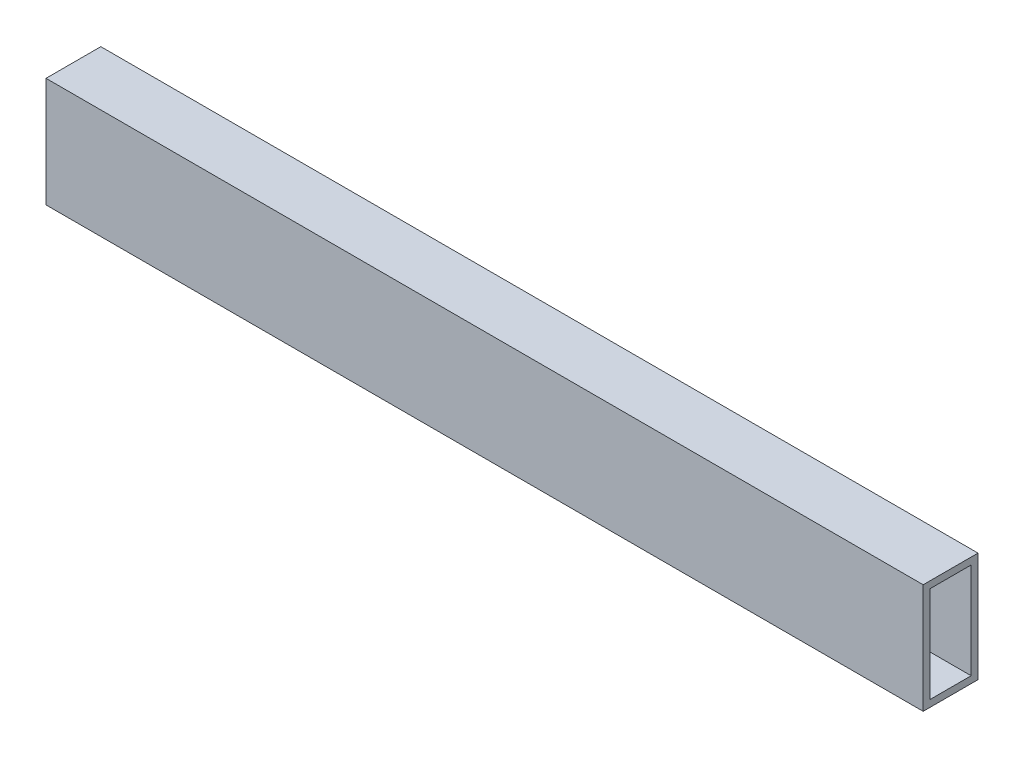
ISO-10303-21;
HEADER;
FILE_DESCRIPTION(('STEP AP214'),'2;1');
FILE_NAME('part.step','',(''),(''),'','','');
FILE_SCHEMA(('AUTOMOTIVE_DESIGN { 1 0 10303 214 1 1 1 1 }'));
ENDSEC;
DATA;
#1=APPLICATION_CONTEXT('core data for automotive mechanical design processes');
#2=APPLICATION_PROTOCOL_DEFINITION('international standard','automotive_design',2000,#1);
#3=PRODUCT_CONTEXT('',#1,'mechanical');
#4=PRODUCT('Part','Part','',(#3));
#5=PRODUCT_RELATED_PRODUCT_CATEGORY('part','',(#4));
#6=PRODUCT_DEFINITION_FORMATION('','',#4);
#7=PRODUCT_DEFINITION_CONTEXT('part definition',#1,'design');
#8=PRODUCT_DEFINITION('design','',#6,#7);
#9=PRODUCT_DEFINITION_SHAPE('','',#8);
#10=(LENGTH_UNIT() NAMED_UNIT(*) SI_UNIT(.MILLI.,.METRE.));
#11=(NAMED_UNIT(*) PLANE_ANGLE_UNIT() SI_UNIT($,.RADIAN.));
#12=(NAMED_UNIT(*) SI_UNIT($,.STERADIAN.) SOLID_ANGLE_UNIT());
#13=UNCERTAINTY_MEASURE_WITH_UNIT(LENGTH_MEASURE(1.E-05),#10,'distance_accuracy_value','');
#14=(GEOMETRIC_REPRESENTATION_CONTEXT(3) GLOBAL_UNCERTAINTY_ASSIGNED_CONTEXT((#13)) GLOBAL_UNIT_ASSIGNED_CONTEXT((#10,
#11,#12)) REPRESENTATION_CONTEXT('',''));
#15=CARTESIAN_POINT('',(0.,0.,0.));
#16=DIRECTION('',(0.,0.,1.));
#17=DIRECTION('',(1.,0.,0.));
#18=AXIS2_PLACEMENT_3D('',#15,#16,#17);
#19=CARTESIAN_POINT('',(203.2,25.4,-12.7));
#20=DIRECTION('',(-1.,0.,0.));
#21=DIRECTION('',(0.,0.,1.));
#22=AXIS2_PLACEMENT_3D('',#19,#20,#21);
#23=PLANE('',#22);
#24=DIRECTION('',(0.,0.,-1.));
#25=VECTOR('',#24,1.);
#26=CARTESIAN_POINT('',(203.2,-25.4,-12.7));
#27=LINE('',#26,#25);
#28=CARTESIAN_POINT('',(203.2,-25.4,12.7));
#29=VERTEX_POINT('',#28);
#30=CARTESIAN_POINT('',(203.2,-25.4,-12.7));
#31=VERTEX_POINT('',#30);
#32=EDGE_CURVE('E127',#29,#31,#27,.T.);
#33=ORIENTED_EDGE('',*,*,#32,.T.);
#34=DIRECTION('',(0.,-1.,0.));
#35=VECTOR('',#34,1.);
#36=CARTESIAN_POINT('',(203.2,25.4,-12.7));
#37=LINE('',#36,#35);
#38=CARTESIAN_POINT('',(203.2,25.4,-12.7));
#39=VERTEX_POINT('',#38);
#40=EDGE_CURVE('E11',#39,#31,#37,.T.);
#41=ORIENTED_EDGE('',*,*,#40,.F.);
#42=DIRECTION('',(0.,0.,-1.));
#43=VECTOR('',#42,1.);
#44=CARTESIAN_POINT('',(203.2,25.4,-12.7));
#45=LINE('',#44,#43);
#46=CARTESIAN_POINT('',(203.2,25.4,12.7));
#47=VERTEX_POINT('',#46);
#48=EDGE_CURVE('E132',#47,#39,#45,.T.);
#49=ORIENTED_EDGE('',*,*,#48,.F.);
#50=DIRECTION('',(0.,-1.,0.));
#51=VECTOR('',#50,1.);
#52=CARTESIAN_POINT('',(203.2,25.4,12.7));
#53=LINE('',#52,#51);
#54=EDGE_CURVE('E142',#47,#29,#53,.T.);
#55=ORIENTED_EDGE('',*,*,#54,.T.);
#56=EDGE_LOOP('',(#33,#41,#49,#55));
#57=FACE_BOUND('',#56,.T.);
#58=DIRECTION('',(0.,0.,-1.));
#59=VECTOR('',#58,1.);
#60=CARTESIAN_POINT('',(203.2,-22.225,-12.7));
#61=LINE('',#60,#59);
#62=CARTESIAN_POINT('',(203.2,-22.225,9.525));
#63=VERTEX_POINT('',#62);
#64=CARTESIAN_POINT('',(203.2,-22.225,-9.525));
#65=VERTEX_POINT('',#64);
#66=EDGE_CURVE('E103',#63,#65,#61,.T.);
#67=ORIENTED_EDGE('',*,*,#66,.F.);
#68=DIRECTION('',(0.,-1.,0.));
#69=VECTOR('',#68,1.);
#70=CARTESIAN_POINT('',(203.2,25.4,9.525));
#71=LINE('',#70,#69);
#72=CARTESIAN_POINT('',(203.2,22.225,9.525));
#73=VERTEX_POINT('',#72);
#74=EDGE_CURVE('E123',#73,#63,#71,.T.);
#75=ORIENTED_EDGE('',*,*,#74,.F.);
#76=DIRECTION('',(0.,0.,-1.));
#77=VECTOR('',#76,1.);
#78=CARTESIAN_POINT('',(203.2,22.225,-12.7));
#79=LINE('',#78,#77);
#80=CARTESIAN_POINT('',(203.2,22.225,-9.525));
#81=VERTEX_POINT('',#80);
#82=EDGE_CURVE('E47',#73,#81,#79,.T.);
#83=ORIENTED_EDGE('',*,*,#82,.T.);
#84=DIRECTION('',(0.,-1.,0.));
#85=VECTOR('',#84,1.);
#86=CARTESIAN_POINT('',(203.2,25.4,-9.525));
#87=LINE('',#86,#85);
#88=EDGE_CURVE('E113',#81,#65,#87,.T.);
#89=ORIENTED_EDGE('',*,*,#88,.T.);
#90=EDGE_LOOP('',(#67,#75,#83,#89));
#91=FACE_BOUND('',#90,.T.);
#92=ADVANCED_FACE('F33',(#57,#91),#23,.F.);
#93=CARTESIAN_POINT('',(-203.2,25.4,-12.7));
#94=DIRECTION('',(1.,0.,0.));
#95=DIRECTION('',(0.,0.,-1.));
#96=AXIS2_PLACEMENT_3D('',#93,#94,#95);
#97=PLANE('',#96);
#98=DIRECTION('',(0.,0.,1.));
#99=VECTOR('',#98,1.);
#100=CARTESIAN_POINT('',(-203.2,-25.4,-12.7));
#101=LINE('',#100,#99);
#102=CARTESIAN_POINT('',(-203.2,-25.4,-12.7));
#103=VERTEX_POINT('',#102);
#104=CARTESIAN_POINT('',(-203.2,-25.4,12.7));
#105=VERTEX_POINT('',#104);
#106=EDGE_CURVE('E147',#103,#105,#101,.T.);
#107=ORIENTED_EDGE('',*,*,#106,.T.);
#108=DIRECTION('',(0.,-1.,0.));
#109=VECTOR('',#108,1.);
#110=CARTESIAN_POINT('',(-203.2,25.4,12.7));
#111=LINE('',#110,#109);
#112=CARTESIAN_POINT('',(-203.2,25.4,12.7));
#113=VERTEX_POINT('',#112);
#114=EDGE_CURVE('E152',#113,#105,#111,.T.);
#115=ORIENTED_EDGE('',*,*,#114,.F.);
#116=DIRECTION('',(0.,0.,1.));
#117=VECTOR('',#116,1.);
#118=CARTESIAN_POINT('',(-203.2,25.4,-12.7));
#119=LINE('',#118,#117);
#120=CARTESIAN_POINT('',(-203.2,25.4,-12.7));
#121=VERTEX_POINT('',#120);
#122=EDGE_CURVE('E138',#121,#113,#119,.T.);
#123=ORIENTED_EDGE('',*,*,#122,.F.);
#124=DIRECTION('',(0.,-1.,0.));
#125=VECTOR('',#124,1.);
#126=CARTESIAN_POINT('',(-203.2,25.4,-12.7));
#127=LINE('',#126,#125);
#128=EDGE_CURVE('E40',#121,#103,#127,.T.);
#129=ORIENTED_EDGE('',*,*,#128,.T.);
#130=EDGE_LOOP('',(#107,#115,#123,#129));
#131=FACE_BOUND('',#130,.T.);
#132=DIRECTION('',(0.,0.,1.));
#133=VECTOR('',#132,1.);
#134=CARTESIAN_POINT('',(-203.2,-22.225,-12.7));
#135=LINE('',#134,#133);
#136=CARTESIAN_POINT('',(-203.2,-22.225,-9.525));
#137=VERTEX_POINT('',#136);
#138=CARTESIAN_POINT('',(-203.2,-22.225,9.525));
#139=VERTEX_POINT('',#138);
#140=EDGE_CURVE('E100',#137,#139,#135,.T.);
#141=ORIENTED_EDGE('',*,*,#140,.F.);
#142=DIRECTION('',(0.,-1.,0.));
#143=VECTOR('',#142,1.);
#144=CARTESIAN_POINT('',(-203.2,25.4,-9.525));
#145=LINE('',#144,#143);
#146=CARTESIAN_POINT('',(-203.2,22.225,-9.525));
#147=VERTEX_POINT('',#146);
#148=EDGE_CURVE('E109',#147,#137,#145,.T.);
#149=ORIENTED_EDGE('',*,*,#148,.F.);
#150=DIRECTION('',(0.,0.,1.));
#151=VECTOR('',#150,1.);
#152=CARTESIAN_POINT('',(-203.2,22.225,-12.7));
#153=LINE('',#152,#151);
#154=CARTESIAN_POINT('',(-203.2,22.225,9.525));
#155=VERTEX_POINT('',#154);
#156=EDGE_CURVE('E52',#147,#155,#153,.T.);
#157=ORIENTED_EDGE('',*,*,#156,.T.);
#158=DIRECTION('',(0.,-1.,0.));
#159=VECTOR('',#158,1.);
#160=CARTESIAN_POINT('',(-203.2,25.4,9.525));
#161=LINE('',#160,#159);
#162=EDGE_CURVE('E114',#155,#139,#161,.T.);
#163=ORIENTED_EDGE('',*,*,#162,.T.);
#164=EDGE_LOOP('',(#141,#149,#157,#163));
#165=FACE_BOUND('',#164,.T.);
#166=ADVANCED_FACE('F117',(#131,#165),#97,.F.);
#167=CARTESIAN_POINT('',(-203.2,25.4,-12.7));
#168=DIRECTION('',(0.,0.,1.));
#169=DIRECTION('',(1.,0.,0.));
#170=AXIS2_PLACEMENT_3D('',#167,#168,#169);
#171=PLANE('',#170);
#172=DIRECTION('',(-1.,0.,0.));
#173=VECTOR('',#172,1.);
#174=CARTESIAN_POINT('',(-203.2,-25.4,-12.7));
#175=LINE('',#174,#173);
#176=EDGE_CURVE('E145',#31,#103,#175,.T.);
#177=ORIENTED_EDGE('',*,*,#176,.T.);
#178=ORIENTED_EDGE('',*,*,#128,.F.);
#179=DIRECTION('',(-1.,0.,0.));
#180=VECTOR('',#179,1.);
#181=CARTESIAN_POINT('',(-203.2,25.4,-12.7));
#182=LINE('',#181,#180);
#183=EDGE_CURVE('E135',#39,#121,#182,.T.);
#184=ORIENTED_EDGE('',*,*,#183,.F.);
#185=ORIENTED_EDGE('',*,*,#40,.T.);
#186=EDGE_LOOP('',(#177,#178,#184,#185));
#187=FACE_BOUND('',#186,.T.);
#188=ADVANCED_FACE('F175',(#187),#171,.F.);
#189=CARTESIAN_POINT('',(-203.2,25.4,12.7));
#190=DIRECTION('',(0.,0.,-1.));
#191=DIRECTION('',(-1.,0.,0.));
#192=AXIS2_PLACEMENT_3D('',#189,#190,#191);
#193=PLANE('',#192);
#194=DIRECTION('',(1.,0.,0.));
#195=VECTOR('',#194,1.);
#196=CARTESIAN_POINT('',(-203.2,-25.4,12.7));
#197=LINE('',#196,#195);
#198=EDGE_CURVE('E136',#105,#29,#197,.T.);
#199=ORIENTED_EDGE('',*,*,#198,.T.);
#200=ORIENTED_EDGE('',*,*,#54,.F.);
#201=DIRECTION('',(1.,0.,0.));
#202=VECTOR('',#201,1.);
#203=CARTESIAN_POINT('',(-203.2,25.4,12.7));
#204=LINE('',#203,#202);
#205=EDGE_CURVE('E140',#113,#47,#204,.T.);
#206=ORIENTED_EDGE('',*,*,#205,.F.);
#207=ORIENTED_EDGE('',*,*,#114,.T.);
#208=EDGE_LOOP('',(#199,#200,#206,#207));
#209=FACE_BOUND('',#208,.T.);
#210=ADVANCED_FACE('F167',(#209),#193,.F.);
#211=CARTESIAN_POINT('',(0.,25.4,0.));
#212=DIRECTION('',(0.,1.,0.));
#213=DIRECTION('',(0.,0.,1.));
#214=AXIS2_PLACEMENT_3D('',#211,#212,#213);
#215=PLANE('',#214);
#216=ORIENTED_EDGE('',*,*,#48,.T.);
#217=ORIENTED_EDGE('',*,*,#183,.T.);
#218=ORIENTED_EDGE('',*,*,#122,.T.);
#219=ORIENTED_EDGE('',*,*,#205,.T.);
#220=EDGE_LOOP('',(#216,#217,#218,#219));
#221=FACE_BOUND('',#220,.T.);
#222=ADVANCED_FACE('F174',(#221),#215,.T.);
#223=CARTESIAN_POINT('',(0.,-25.4,0.));
#224=DIRECTION('',(0.,1.,0.));
#225=DIRECTION('',(0.,0.,1.));
#226=AXIS2_PLACEMENT_3D('',#223,#224,#225);
#227=PLANE('',#226);
#228=ORIENTED_EDGE('',*,*,#32,.F.);
#229=ORIENTED_EDGE('',*,*,#198,.F.);
#230=ORIENTED_EDGE('',*,*,#106,.F.);
#231=ORIENTED_EDGE('',*,*,#176,.F.);
#232=EDGE_LOOP('',(#228,#229,#230,#231));
#233=FACE_BOUND('',#232,.T.);
#234=ADVANCED_FACE('F164',(#233),#227,.F.);
#235=CARTESIAN_POINT('',(-203.2,25.4,-9.525));
#236=DIRECTION('',(0.,0.,1.));
#237=DIRECTION('',(1.,0.,0.));
#238=AXIS2_PLACEMENT_3D('',#235,#236,#237);
#239=PLANE('',#238);
#240=DIRECTION('',(-1.,0.,0.));
#241=VECTOR('',#240,1.);
#242=CARTESIAN_POINT('',(-203.2,-22.225,-9.525));
#243=LINE('',#242,#241);
#244=EDGE_CURVE('E96',#65,#137,#243,.T.);
#245=ORIENTED_EDGE('',*,*,#244,.F.);
#246=ORIENTED_EDGE('',*,*,#88,.F.);
#247=DIRECTION('',(-1.,0.,0.));
#248=VECTOR('',#247,1.);
#249=CARTESIAN_POINT('',(-203.2,22.225,-9.525));
#250=LINE('',#249,#248);
#251=EDGE_CURVE('E111',#81,#147,#250,.T.);
#252=ORIENTED_EDGE('',*,*,#251,.T.);
#253=ORIENTED_EDGE('',*,*,#148,.T.);
#254=EDGE_LOOP('',(#245,#246,#252,#253));
#255=FACE_BOUND('',#254,.T.);
#256=ADVANCED_FACE('F110',(#255),#239,.T.);
#257=CARTESIAN_POINT('',(-203.2,25.4,9.525));
#258=DIRECTION('',(0.,0.,-1.));
#259=DIRECTION('',(-1.,0.,0.));
#260=AXIS2_PLACEMENT_3D('',#257,#258,#259);
#261=PLANE('',#260);
#262=DIRECTION('',(1.,0.,0.));
#263=VECTOR('',#262,1.);
#264=CARTESIAN_POINT('',(-203.2,-22.225,9.525));
#265=LINE('',#264,#263);
#266=EDGE_CURVE('E118',#139,#63,#265,.T.);
#267=ORIENTED_EDGE('',*,*,#266,.F.);
#268=ORIENTED_EDGE('',*,*,#162,.F.);
#269=DIRECTION('',(1.,0.,0.));
#270=VECTOR('',#269,1.);
#271=CARTESIAN_POINT('',(-203.2,22.225,9.525));
#272=LINE('',#271,#270);
#273=EDGE_CURVE('E125',#155,#73,#272,.T.);
#274=ORIENTED_EDGE('',*,*,#273,.T.);
#275=ORIENTED_EDGE('',*,*,#74,.T.);
#276=EDGE_LOOP('',(#267,#268,#274,#275));
#277=FACE_BOUND('',#276,.T.);
#278=ADVANCED_FACE('F201',(#277),#261,.T.);
#279=CARTESIAN_POINT('',(0.,22.225,0.));
#280=DIRECTION('',(0.,1.,0.));
#281=DIRECTION('',(0.,0.,1.));
#282=AXIS2_PLACEMENT_3D('',#279,#280,#281);
#283=PLANE('',#282);
#284=ORIENTED_EDGE('',*,*,#82,.F.);
#285=ORIENTED_EDGE('',*,*,#273,.F.);
#286=ORIENTED_EDGE('',*,*,#156,.F.);
#287=ORIENTED_EDGE('',*,*,#251,.F.);
#288=EDGE_LOOP('',(#284,#285,#286,#287));
#289=FACE_BOUND('',#288,.T.);
#290=ADVANCED_FACE('F211',(#289),#283,.F.);
#291=CARTESIAN_POINT('',(0.,-22.225,0.));
#292=DIRECTION('',(0.,1.,0.));
#293=DIRECTION('',(0.,0.,1.));
#294=AXIS2_PLACEMENT_3D('',#291,#292,#293);
#295=PLANE('',#294);
#296=ORIENTED_EDGE('',*,*,#66,.T.);
#297=ORIENTED_EDGE('',*,*,#244,.T.);
#298=ORIENTED_EDGE('',*,*,#140,.T.);
#299=ORIENTED_EDGE('',*,*,#266,.T.);
#300=EDGE_LOOP('',(#296,#297,#298,#299));
#301=FACE_BOUND('',#300,.T.);
#302=ADVANCED_FACE('F98',(#301),#295,.T.);
#303=CLOSED_SHELL('',(#92,#166,#188,#210,#222,#234,#256,#278,#290,#302));
#304=MANIFOLD_SOLID_BREP('B2',#303);
#305=ADVANCED_BREP_SHAPE_REPRESENTATION('',(#18,#304),#14);
#306=SHAPE_DEFINITION_REPRESENTATION(#9,#305);
ENDSEC;
END-ISO-10303-21;
